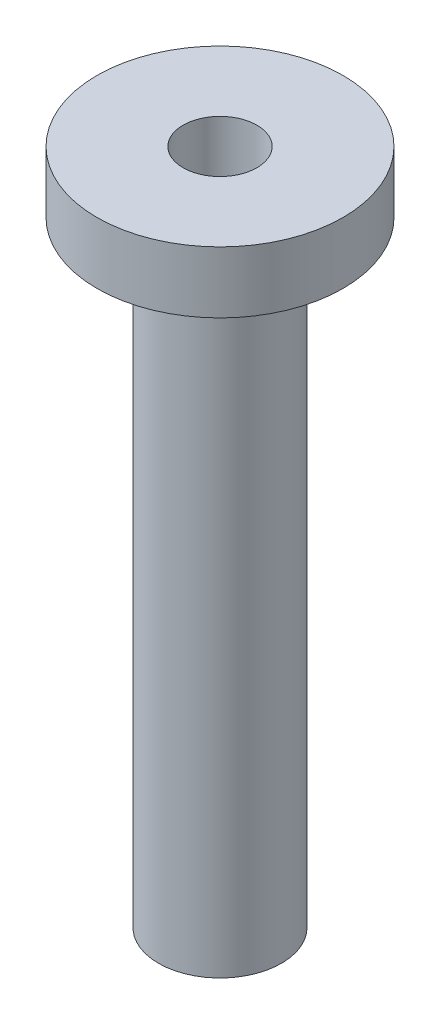
ISO-10303-21;
HEADER;
FILE_DESCRIPTION(('STEP AP214'),'2;1');
FILE_NAME('part.step','',(''),(''),'','','');
FILE_SCHEMA(('AUTOMOTIVE_DESIGN { 1 0 10303 214 1 1 1 1 }'));
ENDSEC;
DATA;
#1=APPLICATION_CONTEXT('core data for automotive mechanical design processes');
#2=APPLICATION_PROTOCOL_DEFINITION('international standard','automotive_design',2000,#1);
#3=PRODUCT_CONTEXT('',#1,'mechanical');
#4=PRODUCT('Part','Part','',(#3));
#5=PRODUCT_RELATED_PRODUCT_CATEGORY('part','',(#4));
#6=PRODUCT_DEFINITION_FORMATION('','',#4);
#7=PRODUCT_DEFINITION_CONTEXT('part definition',#1,'design');
#8=PRODUCT_DEFINITION('design','',#6,#7);
#9=PRODUCT_DEFINITION_SHAPE('','',#8);
#10=(LENGTH_UNIT() NAMED_UNIT(*) SI_UNIT(.MILLI.,.METRE.));
#11=(NAMED_UNIT(*) PLANE_ANGLE_UNIT() SI_UNIT($,.RADIAN.));
#12=(NAMED_UNIT(*) SI_UNIT($,.STERADIAN.) SOLID_ANGLE_UNIT());
#13=UNCERTAINTY_MEASURE_WITH_UNIT(LENGTH_MEASURE(1.E-05),#10,'distance_accuracy_value','');
#14=(GEOMETRIC_REPRESENTATION_CONTEXT(3) GLOBAL_UNCERTAINTY_ASSIGNED_CONTEXT((#13)) GLOBAL_UNIT_ASSIGNED_CONTEXT((#10,
#11,#12)) REPRESENTATION_CONTEXT('',''));
#15=CARTESIAN_POINT('',(0.,0.,0.));
#16=DIRECTION('',(0.,0.,1.));
#17=DIRECTION('',(1.,0.,0.));
#18=AXIS2_PLACEMENT_3D('',#15,#16,#17);
#19=CARTESIAN_POINT('',(0.,0.,0.));
#20=DIRECTION('',(0.,1.,0.));
#21=DIRECTION('',(0.,0.,1.));
#22=AXIS2_PLACEMENT_3D('',#19,#20,#21);
#23=CYLINDRICAL_SURFACE('',#22,12.7);
#24=CARTESIAN_POINT('',(0.,-6.35,0.));
#25=DIRECTION('',(0.,1.,0.));
#26=DIRECTION('',(0.,0.,1.));
#27=AXIS2_PLACEMENT_3D('',#24,#25,#26);
#28=CIRCLE('',#27,12.7);
#29=CARTESIAN_POINT('',(0.,-6.35,12.7));
#30=VERTEX_POINT('',#29);
#31=EDGE_CURVE('E10',#30,#30,#28,.T.);
#32=ORIENTED_EDGE('',*,*,#31,.T.);
#33=EDGE_LOOP('',(#32));
#34=FACE_BOUND('',#33,.T.);
#35=CARTESIAN_POINT('',(0.,0.,0.));
#36=DIRECTION('',(0.,1.,0.));
#37=DIRECTION('',(0.,0.,1.));
#38=AXIS2_PLACEMENT_3D('',#35,#36,#37);
#39=CIRCLE('',#38,12.7);
#40=CARTESIAN_POINT('',(0.,0.,12.7));
#41=VERTEX_POINT('',#40);
#42=EDGE_CURVE('E80',#41,#41,#39,.T.);
#43=ORIENTED_EDGE('',*,*,#42,.F.);
#44=EDGE_LOOP('',(#43));
#45=FACE_BOUND('',#44,.T.);
#46=ADVANCED_FACE('F37',(#34,#45),#23,.T.);
#47=CARTESIAN_POINT('',(-12.7,-6.35,0.));
#48=DIRECTION('',(0.,-1.,0.));
#49=DIRECTION('',(0.,0.,-1.));
#50=AXIS2_PLACEMENT_3D('',#47,#48,#49);
#51=PLANE('',#50);
#52=CARTESIAN_POINT('',(0.,-6.35,0.));
#53=DIRECTION('',(0.,1.,0.));
#54=DIRECTION('',(0.,0.,1.));
#55=AXIS2_PLACEMENT_3D('',#52,#53,#54);
#56=CIRCLE('',#55,11.1125);
#57=CARTESIAN_POINT('',(0.,-6.35,11.1125));
#58=VERTEX_POINT('',#57);
#59=EDGE_CURVE('E44',#58,#58,#56,.T.);
#60=ORIENTED_EDGE('',*,*,#59,.T.);
#61=EDGE_LOOP('',(#60));
#62=FACE_BOUND('',#61,.T.);
#63=ORIENTED_EDGE('',*,*,#31,.F.);
#64=EDGE_LOOP('',(#63));
#65=FACE_BOUND('',#64,.T.);
#66=ADVANCED_FACE('F89',(#62,#65),#51,.T.);
#67=CARTESIAN_POINT('',(0.,0.,0.));
#68=DIRECTION('',(0.,1.,0.));
#69=DIRECTION('',(0.,0.,1.));
#70=AXIS2_PLACEMENT_3D('',#67,#68,#69);
#71=CYLINDRICAL_SURFACE('',#70,11.1125);
#72=CARTESIAN_POINT('',(0.,-4.318,0.));
#73=DIRECTION('',(0.,1.,0.));
#74=DIRECTION('',(0.,0.,1.));
#75=AXIS2_PLACEMENT_3D('',#72,#73,#74);
#76=CIRCLE('',#75,11.1125);
#77=CARTESIAN_POINT('',(0.,-4.318,11.1125));
#78=VERTEX_POINT('',#77);
#79=EDGE_CURVE('E49',#78,#78,#76,.T.);
#80=ORIENTED_EDGE('',*,*,#79,.T.);
#81=EDGE_LOOP('',(#80));
#82=FACE_BOUND('',#81,.T.);
#83=ORIENTED_EDGE('',*,*,#59,.F.);
#84=EDGE_LOOP('',(#83));
#85=FACE_BOUND('',#84,.T.);
#86=ADVANCED_FACE('F93',(#82,#85),#71,.F.);
#87=CARTESIAN_POINT('',(-11.1125,-4.318,0.));
#88=DIRECTION('',(0.,-1.,0.));
#89=DIRECTION('',(0.,0.,-1.));
#90=AXIS2_PLACEMENT_3D('',#87,#88,#89);
#91=PLANE('',#90);
#92=CARTESIAN_POINT('',(0.,-4.318,0.));
#93=DIRECTION('',(0.,1.,0.));
#94=DIRECTION('',(0.,0.,1.));
#95=AXIS2_PLACEMENT_3D('',#92,#93,#94);
#96=CIRCLE('',#95,8.0645);
#97=CARTESIAN_POINT('',(0.,-4.318,8.0645));
#98=VERTEX_POINT('',#97);
#99=EDGE_CURVE('E54',#98,#98,#96,.T.);
#100=ORIENTED_EDGE('',*,*,#99,.T.);
#101=EDGE_LOOP('',(#100));
#102=FACE_BOUND('',#101,.T.);
#103=ORIENTED_EDGE('',*,*,#79,.F.);
#104=EDGE_LOOP('',(#103));
#105=FACE_BOUND('',#104,.T.);
#106=ADVANCED_FACE('F97',(#102,#105),#91,.T.);
#107=CARTESIAN_POINT('',(0.,0.,0.));
#108=DIRECTION('',(0.,1.,0.));
#109=DIRECTION('',(0.,0.,1.));
#110=AXIS2_PLACEMENT_3D('',#107,#108,#109);
#111=CYLINDRICAL_SURFACE('',#110,8.0645);
#112=CARTESIAN_POINT('',(0.,-6.35,0.));
#113=DIRECTION('',(0.,1.,0.));
#114=DIRECTION('',(0.,0.,1.));
#115=AXIS2_PLACEMENT_3D('',#112,#113,#114);
#116=CIRCLE('',#115,8.0645);
#117=CARTESIAN_POINT('',(0.,-6.35,8.0645));
#118=VERTEX_POINT('',#117);
#119=EDGE_CURVE('E60',#118,#118,#116,.T.);
#120=ORIENTED_EDGE('',*,*,#119,.T.);
#121=EDGE_LOOP('',(#120));
#122=FACE_BOUND('',#121,.T.);
#123=ORIENTED_EDGE('',*,*,#99,.F.);
#124=EDGE_LOOP('',(#123));
#125=FACE_BOUND('',#124,.T.);
#126=ADVANCED_FACE('F104',(#122,#125),#111,.T.);
#127=CARTESIAN_POINT('',(-8.0645,-6.35,0.));
#128=DIRECTION('',(0.,-1.,0.));
#129=DIRECTION('',(0.,0.,-1.));
#130=AXIS2_PLACEMENT_3D('',#127,#128,#129);
#131=PLANE('',#130);
#132=CARTESIAN_POINT('',(0.,-6.35,0.));
#133=DIRECTION('',(0.,1.,0.));
#134=DIRECTION('',(0.,0.,1.));
#135=AXIS2_PLACEMENT_3D('',#132,#133,#134);
#136=CIRCLE('',#135,6.35);
#137=CARTESIAN_POINT('',(0.,-6.35,6.35));
#138=VERTEX_POINT('',#137);
#139=EDGE_CURVE('E64',#138,#138,#136,.T.);
#140=ORIENTED_EDGE('',*,*,#139,.T.);
#141=EDGE_LOOP('',(#140));
#142=FACE_BOUND('',#141,.T.);
#143=ORIENTED_EDGE('',*,*,#119,.F.);
#144=EDGE_LOOP('',(#143));
#145=FACE_BOUND('',#144,.T.);
#146=ADVANCED_FACE('F108',(#142,#145),#131,.T.);
#147=CARTESIAN_POINT('',(0.,0.,0.));
#148=DIRECTION('',(0.,1.,0.));
#149=DIRECTION('',(0.,0.,1.));
#150=AXIS2_PLACEMENT_3D('',#147,#148,#149);
#151=CYLINDRICAL_SURFACE('',#150,6.35);
#152=CARTESIAN_POINT('',(0.,-69.85,0.));
#153=DIRECTION('',(0.,1.,0.));
#154=DIRECTION('',(0.,0.,1.));
#155=AXIS2_PLACEMENT_3D('',#152,#153,#154);
#156=CIRCLE('',#155,6.34999999999999);
#157=CARTESIAN_POINT('',(0.,-69.85,6.34999999999999));
#158=VERTEX_POINT('',#157);
#159=EDGE_CURVE('E68',#158,#158,#156,.T.);
#160=ORIENTED_EDGE('',*,*,#159,.T.);
#161=EDGE_LOOP('',(#160));
#162=FACE_BOUND('',#161,.T.);
#163=ORIENTED_EDGE('',*,*,#139,.F.);
#164=EDGE_LOOP('',(#163));
#165=FACE_BOUND('',#164,.T.);
#166=ADVANCED_FACE('F112',(#162,#165),#151,.T.);
#167=CARTESIAN_POINT('',(0.,-69.85,0.));
#168=DIRECTION('',(0.,-1.,0.));
#169=DIRECTION('',(0.,0.,-1.));
#170=AXIS2_PLACEMENT_3D('',#167,#168,#169);
#171=CONICAL_SURFACE('',#170,6.34999999999999,0.785398163397444);
#172=CARTESIAN_POINT('',(0.,-67.31,0.));
#173=DIRECTION('',(0.,1.,0.));
#174=DIRECTION('',(0.,0.,1.));
#175=AXIS2_PLACEMENT_3D('',#172,#173,#174);
#176=CIRCLE('',#175,3.81);
#177=CARTESIAN_POINT('',(0.,-67.31,3.81));
#178=VERTEX_POINT('',#177);
#179=EDGE_CURVE('E72',#178,#178,#176,.T.);
#180=ORIENTED_EDGE('',*,*,#179,.T.);
#181=EDGE_LOOP('',(#180));
#182=FACE_BOUND('',#181,.T.);
#183=ORIENTED_EDGE('',*,*,#159,.F.);
#184=EDGE_LOOP('',(#183));
#185=FACE_BOUND('',#184,.T.);
#186=ADVANCED_FACE('F116',(#182,#185),#171,.F.);
#187=CARTESIAN_POINT('',(0.,0.,0.));
#188=DIRECTION('',(0.,1.,0.));
#189=DIRECTION('',(0.,0.,1.));
#190=AXIS2_PLACEMENT_3D('',#187,#188,#189);
#191=CYLINDRICAL_SURFACE('',#190,3.81);
#192=CARTESIAN_POINT('',(0.,0.,0.));
#193=DIRECTION('',(0.,1.,0.));
#194=DIRECTION('',(0.,0.,1.));
#195=AXIS2_PLACEMENT_3D('',#192,#193,#194);
#196=CIRCLE('',#195,3.81);
#197=CARTESIAN_POINT('',(0.,0.,3.81));
#198=VERTEX_POINT('',#197);
#199=EDGE_CURVE('E76',#198,#198,#196,.T.);
#200=ORIENTED_EDGE('',*,*,#199,.T.);
#201=EDGE_LOOP('',(#200));
#202=FACE_BOUND('',#201,.T.);
#203=ORIENTED_EDGE('',*,*,#179,.F.);
#204=EDGE_LOOP('',(#203));
#205=FACE_BOUND('',#204,.T.);
#206=ADVANCED_FACE('F120',(#202,#205),#191,.F.);
#207=CARTESIAN_POINT('',(-3.81,0.,0.));
#208=DIRECTION('',(0.,1.,0.));
#209=DIRECTION('',(0.,0.,1.));
#210=AXIS2_PLACEMENT_3D('',#207,#208,#209);
#211=PLANE('',#210);
#212=ORIENTED_EDGE('',*,*,#42,.T.);
#213=EDGE_LOOP('',(#212));
#214=FACE_BOUND('',#213,.T.);
#215=ORIENTED_EDGE('',*,*,#199,.F.);
#216=EDGE_LOOP('',(#215));
#217=FACE_BOUND('',#216,.T.);
#218=ADVANCED_FACE('F85',(#214,#217),#211,.T.);
#219=CLOSED_SHELL('',(#46,#66,#86,#106,#126,#146,#166,#186,#206,#218));
#220=MANIFOLD_SOLID_BREP('B2',#219);
#221=ADVANCED_BREP_SHAPE_REPRESENTATION('',(#18,#220),#14);
#222=SHAPE_DEFINITION_REPRESENTATION(#9,#221);
ENDSEC;
END-ISO-10303-21;
